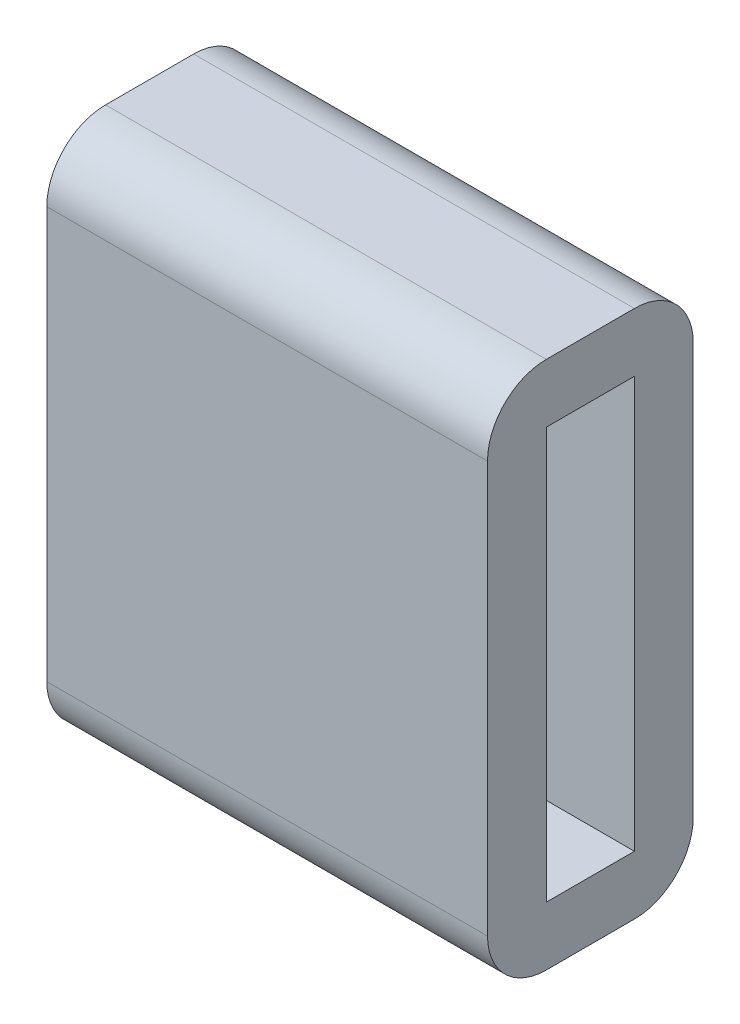
ISO-10303-21;
HEADER;
FILE_DESCRIPTION(('STEP AP214'),'2;1');
FILE_NAME('part.step','',(''),(''),'','','');
FILE_SCHEMA(('AUTOMOTIVE_DESIGN { 1 0 10303 214 1 1 1 1 }'));
ENDSEC;
DATA;
#1=APPLICATION_CONTEXT('core data for automotive mechanical design processes');
#2=APPLICATION_PROTOCOL_DEFINITION('international standard','automotive_design',2000,#1);
#3=PRODUCT_CONTEXT('',#1,'mechanical');
#4=PRODUCT('Part','Part','',(#3));
#5=PRODUCT_RELATED_PRODUCT_CATEGORY('part','',(#4));
#6=PRODUCT_DEFINITION_FORMATION('','',#4);
#7=PRODUCT_DEFINITION_CONTEXT('part definition',#1,'design');
#8=PRODUCT_DEFINITION('design','',#6,#7);
#9=PRODUCT_DEFINITION_SHAPE('','',#8);
#10=(LENGTH_UNIT() NAMED_UNIT(*) SI_UNIT(.MILLI.,.METRE.));
#11=(NAMED_UNIT(*) PLANE_ANGLE_UNIT() SI_UNIT($,.RADIAN.));
#12=(NAMED_UNIT(*) SI_UNIT($,.STERADIAN.) SOLID_ANGLE_UNIT());
#13=UNCERTAINTY_MEASURE_WITH_UNIT(LENGTH_MEASURE(1.E-05),#10,'distance_accuracy_value','');
#14=(GEOMETRIC_REPRESENTATION_CONTEXT(3) GLOBAL_UNCERTAINTY_ASSIGNED_CONTEXT((#13)) GLOBAL_UNIT_ASSIGNED_CONTEXT((#10,
#11,#12)) REPRESENTATION_CONTEXT('',''));
#15=CARTESIAN_POINT('',(0.,0.,0.));
#16=DIRECTION('',(0.,0.,1.));
#17=DIRECTION('',(1.,0.,0.));
#18=AXIS2_PLACEMENT_3D('',#15,#16,#17);
#19=CARTESIAN_POINT('',(3.75,4.5,3.5));
#20=DIRECTION('',(-1.,0.,0.));
#21=DIRECTION('',(0.,-1.,0.));
#22=AXIS2_PLACEMENT_3D('',#19,#20,#21);
#23=PLANE('',#22);
#24=DIRECTION('',(0.,0.,-1.));
#25=VECTOR('',#24,1.);
#26=CARTESIAN_POINT('',(3.75,-4.5,3.5));
#27=LINE('',#26,#25);
#28=CARTESIAN_POINT('',(3.75,-4.5,2.5));
#29=VERTEX_POINT('',#28);
#30=CARTESIAN_POINT('',(3.75,-4.5,1.));
#31=VERTEX_POINT('',#30);
#32=EDGE_CURVE('E159',#29,#31,#27,.T.);
#33=ORIENTED_EDGE('',*,*,#32,.T.);
#34=CARTESIAN_POINT('',(3.75,-3.5,1.));
#35=DIRECTION('',(-1.,0.,0.));
#36=DIRECTION('',(0.,-1.,0.));
#37=AXIS2_PLACEMENT_3D('',#34,#35,#36);
#38=CIRCLE('',#37,1.);
#39=CARTESIAN_POINT('',(3.75,-3.5,0.));
#40=VERTEX_POINT('',#39);
#41=EDGE_CURVE('E185',#31,#40,#38,.F.);
#42=ORIENTED_EDGE('',*,*,#41,.T.);
#43=DIRECTION('',(0.,1.,0.));
#44=VECTOR('',#43,1.);
#45=CARTESIAN_POINT('',(3.75,4.5,0.));
#46=LINE('',#45,#44);
#47=CARTESIAN_POINT('',(3.75,3.5,0.));
#48=VERTEX_POINT('',#47);
#49=EDGE_CURVE('E144',#40,#48,#46,.T.);
#50=ORIENTED_EDGE('',*,*,#49,.T.);
#51=CARTESIAN_POINT('',(3.75,3.5,1.));
#52=DIRECTION('',(-1.,0.,0.));
#53=DIRECTION('',(0.,-1.,0.));
#54=AXIS2_PLACEMENT_3D('',#51,#52,#53);
#55=CIRCLE('',#54,1.);
#56=CARTESIAN_POINT('',(3.75,4.5,1.));
#57=VERTEX_POINT('',#56);
#58=EDGE_CURVE('E183',#48,#57,#55,.F.);
#59=ORIENTED_EDGE('',*,*,#58,.T.);
#60=DIRECTION('',(0.,0.,-1.));
#61=VECTOR('',#60,1.);
#62=CARTESIAN_POINT('',(3.75,4.5,3.5));
#63=LINE('',#62,#61);
#64=CARTESIAN_POINT('',(3.75,4.5,2.5));
#65=VERTEX_POINT('',#64);
#66=EDGE_CURVE('E171',#65,#57,#63,.T.);
#67=ORIENTED_EDGE('',*,*,#66,.F.);
#68=CARTESIAN_POINT('',(3.75,3.5,2.5));
#69=DIRECTION('',(-1.,0.,0.));
#70=DIRECTION('',(0.,-1.,0.));
#71=AXIS2_PLACEMENT_3D('',#68,#69,#70);
#72=CIRCLE('',#71,1.);
#73=CARTESIAN_POINT('',(3.75,3.5,3.5));
#74=VERTEX_POINT('',#73);
#75=EDGE_CURVE('E179',#65,#74,#72,.F.);
#76=ORIENTED_EDGE('',*,*,#75,.T.);
#77=DIRECTION('',(0.,1.,0.));
#78=VECTOR('',#77,1.);
#79=CARTESIAN_POINT('',(3.75,4.5,3.5));
#80=LINE('',#79,#78);
#81=CARTESIAN_POINT('',(3.75,-3.5,3.5));
#82=VERTEX_POINT('',#81);
#83=EDGE_CURVE('E154',#82,#74,#80,.T.);
#84=ORIENTED_EDGE('',*,*,#83,.F.);
#85=CARTESIAN_POINT('',(3.75,-3.5,2.5));
#86=DIRECTION('',(-1.,0.,0.));
#87=DIRECTION('',(0.,-1.,0.));
#88=AXIS2_PLACEMENT_3D('',#85,#86,#87);
#89=CIRCLE('',#88,1.);
#90=EDGE_CURVE('E181',#82,#29,#89,.F.);
#91=ORIENTED_EDGE('',*,*,#90,.T.);
#92=EDGE_LOOP('',(#33,#42,#50,#59,#67,#76,#84,#91));
#93=FACE_BOUND('',#92,.T.);
#94=DIRECTION('',(0.,0.,-1.));
#95=VECTOR('',#94,1.);
#96=CARTESIAN_POINT('',(3.75,3.5,2.5));
#97=LINE('',#96,#95);
#98=CARTESIAN_POINT('',(3.75,3.5,2.5));
#99=VERTEX_POINT('',#98);
#100=CARTESIAN_POINT('',(3.75,3.5,1.));
#101=VERTEX_POINT('',#100);
#102=EDGE_CURVE('E48',#99,#101,#97,.T.);
#103=ORIENTED_EDGE('',*,*,#102,.T.);
#104=DIRECTION('',(0.,-1.,0.));
#105=VECTOR('',#104,1.);
#106=CARTESIAN_POINT('',(3.75,3.5,1.));
#107=LINE('',#106,#105);
#108=CARTESIAN_POINT('',(3.75,-3.5,0.999999999999999));
#109=VERTEX_POINT('',#108);
#110=EDGE_CURVE('E143',#101,#109,#107,.T.);
#111=ORIENTED_EDGE('',*,*,#110,.T.);
#112=DIRECTION('',(0.,0.,-1.));
#113=VECTOR('',#112,1.);
#114=CARTESIAN_POINT('',(3.75,-3.5,2.5));
#115=LINE('',#114,#113);
#116=CARTESIAN_POINT('',(3.75,-3.5,2.5));
#117=VERTEX_POINT('',#116);
#118=EDGE_CURVE('E339',#117,#109,#115,.T.);
#119=ORIENTED_EDGE('',*,*,#118,.F.);
#120=DIRECTION('',(0.,-1.,0.));
#121=VECTOR('',#120,1.);
#122=CARTESIAN_POINT('',(3.75,3.5,2.5));
#123=LINE('',#122,#121);
#124=EDGE_CURVE('E139',#99,#117,#123,.T.);
#125=ORIENTED_EDGE('',*,*,#124,.F.);
#126=EDGE_LOOP('',(#103,#111,#119,#125));
#127=FACE_BOUND('',#126,.T.);
#128=ADVANCED_FACE('F33',(#93,#127),#23,.F.);
#129=CARTESIAN_POINT('',(-3.75,4.5,3.5));
#130=DIRECTION('',(0.,-1.,0.));
#131=DIRECTION('',(0.,0.,-1.));
#132=AXIS2_PLACEMENT_3D('',#129,#130,#131);
#133=PLANE('',#132);
#134=ORIENTED_EDGE('',*,*,#66,.T.);
#135=DIRECTION('',(-1.,0.,0.));
#136=VECTOR('',#135,1.);
#137=CARTESIAN_POINT('',(-3.75,4.5,1.));
#138=LINE('',#137,#136);
#139=CARTESIAN_POINT('',(-3.75,4.5,1.));
#140=VERTEX_POINT('',#139);
#141=EDGE_CURVE('E200',#57,#140,#138,.T.);
#142=ORIENTED_EDGE('',*,*,#141,.T.);
#143=DIRECTION('',(0.,0.,-1.));
#144=VECTOR('',#143,1.);
#145=CARTESIAN_POINT('',(-3.75,4.5,3.5));
#146=LINE('',#145,#144);
#147=CARTESIAN_POINT('',(-3.75,4.5,2.5));
#148=VERTEX_POINT('',#147);
#149=EDGE_CURVE('E168',#148,#140,#146,.T.);
#150=ORIENTED_EDGE('',*,*,#149,.F.);
#151=DIRECTION('',(-1.,0.,0.));
#152=VECTOR('',#151,1.);
#153=CARTESIAN_POINT('',(3.75,4.5,2.5));
#154=LINE('',#153,#152);
#155=EDGE_CURVE('E198',#148,#65,#154,.F.);
#156=ORIENTED_EDGE('',*,*,#155,.T.);
#157=EDGE_LOOP('',(#134,#142,#150,#156));
#158=FACE_BOUND('',#157,.T.);
#159=ADVANCED_FACE('F224',(#158),#133,.F.);
#160=CARTESIAN_POINT('',(-3.75,4.5,3.5));
#161=DIRECTION('',(1.,0.,0.));
#162=DIRECTION('',(0.,0.,-1.));
#163=AXIS2_PLACEMENT_3D('',#160,#161,#162);
#164=PLANE('',#163);
#165=DIRECTION('',(0.,-1.,0.));
#166=VECTOR('',#165,1.);
#167=CARTESIAN_POINT('',(-3.75,4.5,0.));
#168=LINE('',#167,#166);
#169=CARTESIAN_POINT('',(-3.75,3.5,0.));
#170=VERTEX_POINT('',#169);
#171=CARTESIAN_POINT('',(-3.75,-3.5,0.));
#172=VERTEX_POINT('',#171);
#173=EDGE_CURVE('E148',#170,#172,#168,.T.);
#174=ORIENTED_EDGE('',*,*,#173,.T.);
#175=CARTESIAN_POINT('',(-3.75,-3.5,1.));
#176=DIRECTION('',(1.,0.,0.));
#177=DIRECTION('',(0.,0.,-1.));
#178=AXIS2_PLACEMENT_3D('',#175,#176,#177);
#179=CIRCLE('',#178,1.);
#180=CARTESIAN_POINT('',(-3.75,-4.5,1.));
#181=VERTEX_POINT('',#180);
#182=EDGE_CURVE('E196',#172,#181,#179,.F.);
#183=ORIENTED_EDGE('',*,*,#182,.T.);
#184=DIRECTION('',(0.,0.,-1.));
#185=VECTOR('',#184,1.);
#186=CARTESIAN_POINT('',(-3.75,-4.5,3.5));
#187=LINE('',#186,#185);
#188=CARTESIAN_POINT('',(-3.75,-4.5,2.5));
#189=VERTEX_POINT('',#188);
#190=EDGE_CURVE('E165',#189,#181,#187,.T.);
#191=ORIENTED_EDGE('',*,*,#190,.F.);
#192=CARTESIAN_POINT('',(-3.75,-3.5,2.5));
#193=DIRECTION('',(1.,0.,0.));
#194=DIRECTION('',(0.,0.,-1.));
#195=AXIS2_PLACEMENT_3D('',#192,#193,#194);
#196=CIRCLE('',#195,1.);
#197=CARTESIAN_POINT('',(-3.75,-3.5,3.5));
#198=VERTEX_POINT('',#197);
#199=EDGE_CURVE('E193',#189,#198,#196,.F.);
#200=ORIENTED_EDGE('',*,*,#199,.T.);
#201=DIRECTION('',(0.,-1.,0.));
#202=VECTOR('',#201,1.);
#203=CARTESIAN_POINT('',(-3.75,4.5,3.5));
#204=LINE('',#203,#202);
#205=CARTESIAN_POINT('',(-3.75,3.5,3.5));
#206=VERTEX_POINT('',#205);
#207=EDGE_CURVE('E157',#206,#198,#204,.T.);
#208=ORIENTED_EDGE('',*,*,#207,.F.);
#209=CARTESIAN_POINT('',(-3.75,3.5,2.5));
#210=DIRECTION('',(1.,0.,0.));
#211=DIRECTION('',(0.,0.,-1.));
#212=AXIS2_PLACEMENT_3D('',#209,#210,#211);
#213=CIRCLE('',#212,1.);
#214=EDGE_CURVE('E191',#206,#148,#213,.F.);
#215=ORIENTED_EDGE('',*,*,#214,.T.);
#216=ORIENTED_EDGE('',*,*,#149,.T.);
#217=CARTESIAN_POINT('',(-3.75,3.5,1.));
#218=DIRECTION('',(1.,0.,0.));
#219=DIRECTION('',(0.,0.,-1.));
#220=AXIS2_PLACEMENT_3D('',#217,#218,#219);
#221=CIRCLE('',#220,1.);
#222=EDGE_CURVE('E56',#140,#170,#221,.F.);
#223=ORIENTED_EDGE('',*,*,#222,.T.);
#224=EDGE_LOOP('',(#174,#183,#191,#200,#208,#215,#216,#223));
#225=FACE_BOUND('',#224,.T.);
#226=ADVANCED_FACE('F211',(#225),#164,.F.);
#227=CARTESIAN_POINT('',(-3.75,-4.5,3.5));
#228=DIRECTION('',(0.,1.,0.));
#229=DIRECTION('',(0.,0.,1.));
#230=AXIS2_PLACEMENT_3D('',#227,#228,#229);
#231=PLANE('',#230);
#232=ORIENTED_EDGE('',*,*,#190,.T.);
#233=DIRECTION('',(1.,0.,0.));
#234=VECTOR('',#233,1.);
#235=CARTESIAN_POINT('',(-3.75,-4.5,1.));
#236=LINE('',#235,#234);
#237=EDGE_CURVE('E176',#181,#31,#236,.T.);
#238=ORIENTED_EDGE('',*,*,#237,.T.);
#239=ORIENTED_EDGE('',*,*,#32,.F.);
#240=DIRECTION('',(1.,0.,0.));
#241=VECTOR('',#240,1.);
#242=CARTESIAN_POINT('',(-3.75,-4.5,2.5));
#243=LINE('',#242,#241);
#244=EDGE_CURVE('E174',#29,#189,#243,.F.);
#245=ORIENTED_EDGE('',*,*,#244,.T.);
#246=EDGE_LOOP('',(#232,#238,#239,#245));
#247=FACE_BOUND('',#246,.T.);
#248=ADVANCED_FACE('F237',(#247),#231,.F.);
#249=CARTESIAN_POINT('',(0.,0.,3.5));
#250=DIRECTION('',(0.,0.,1.));
#251=DIRECTION('',(1.,0.,0.));
#252=AXIS2_PLACEMENT_3D('',#249,#250,#251);
#253=PLANE('',#252);
#254=ORIENTED_EDGE('',*,*,#207,.T.);
#255=DIRECTION('',(1.,0.,0.));
#256=VECTOR('',#255,1.);
#257=CARTESIAN_POINT('',(3.75,-3.5,3.5));
#258=LINE('',#257,#256);
#259=EDGE_CURVE('E11',#198,#82,#258,.T.);
#260=ORIENTED_EDGE('',*,*,#259,.T.);
#261=ORIENTED_EDGE('',*,*,#83,.T.);
#262=DIRECTION('',(-1.,0.,0.));
#263=VECTOR('',#262,1.);
#264=CARTESIAN_POINT('',(-3.75,3.5,3.5));
#265=LINE('',#264,#263);
#266=EDGE_CURVE('E41',#74,#206,#265,.T.);
#267=ORIENTED_EDGE('',*,*,#266,.T.);
#268=EDGE_LOOP('',(#254,#260,#261,#267));
#269=FACE_BOUND('',#268,.T.);
#270=ADVANCED_FACE('F205',(#269),#253,.T.);
#271=CARTESIAN_POINT('',(0.,0.,0.));
#272=DIRECTION('',(0.,0.,1.));
#273=DIRECTION('',(1.,0.,0.));
#274=AXIS2_PLACEMENT_3D('',#271,#272,#273);
#275=PLANE('',#274);
#276=ORIENTED_EDGE('',*,*,#49,.F.);
#277=DIRECTION('',(1.,0.,0.));
#278=VECTOR('',#277,1.);
#279=CARTESIAN_POINT('',(0.,-3.5,0.));
#280=LINE('',#279,#278);
#281=EDGE_CURVE('E189',#40,#172,#280,.F.);
#282=ORIENTED_EDGE('',*,*,#281,.T.);
#283=ORIENTED_EDGE('',*,*,#173,.F.);
#284=DIRECTION('',(-1.,0.,0.));
#285=VECTOR('',#284,1.);
#286=CARTESIAN_POINT('',(0.,3.5,0.));
#287=LINE('',#286,#285);
#288=EDGE_CURVE('E187',#170,#48,#287,.F.);
#289=ORIENTED_EDGE('',*,*,#288,.T.);
#290=EDGE_LOOP('',(#276,#282,#283,#289));
#291=FACE_BOUND('',#290,.T.);
#292=ADVANCED_FACE('F229',(#291),#275,.F.);
#293=CARTESIAN_POINT('',(-3.75,-3.5,1.));
#294=DIRECTION('',(1.,0.,0.));
#295=DIRECTION('',(0.,0.,-1.));
#296=AXIS2_PLACEMENT_3D('',#293,#294,#295);
#297=CYLINDRICAL_SURFACE('',#296,1.);
#298=ORIENTED_EDGE('',*,*,#182,.F.);
#299=ORIENTED_EDGE('',*,*,#281,.F.);
#300=ORIENTED_EDGE('',*,*,#41,.F.);
#301=ORIENTED_EDGE('',*,*,#237,.F.);
#302=EDGE_LOOP('',(#298,#299,#300,#301));
#303=FACE_BOUND('',#302,.T.);
#304=ADVANCED_FACE('F234',(#303),#297,.T.);
#305=CARTESIAN_POINT('',(-3.75,3.5,1.));
#306=DIRECTION('',(-1.,0.,0.));
#307=DIRECTION('',(0.,0.,1.));
#308=AXIS2_PLACEMENT_3D('',#305,#306,#307);
#309=CYLINDRICAL_SURFACE('',#308,1.);
#310=ORIENTED_EDGE('',*,*,#58,.F.);
#311=ORIENTED_EDGE('',*,*,#288,.F.);
#312=ORIENTED_EDGE('',*,*,#222,.F.);
#313=ORIENTED_EDGE('',*,*,#141,.F.);
#314=EDGE_LOOP('',(#310,#311,#312,#313));
#315=FACE_BOUND('',#314,.T.);
#316=ADVANCED_FACE('F232',(#315),#309,.T.);
#317=CARTESIAN_POINT('',(0.,-3.5,2.5));
#318=DIRECTION('',(-1.,0.,0.));
#319=DIRECTION('',(0.,0.,1.));
#320=AXIS2_PLACEMENT_3D('',#317,#318,#319);
#321=CYLINDRICAL_SURFACE('',#320,1.);
#322=ORIENTED_EDGE('',*,*,#199,.F.);
#323=ORIENTED_EDGE('',*,*,#244,.F.);
#324=ORIENTED_EDGE('',*,*,#90,.F.);
#325=ORIENTED_EDGE('',*,*,#259,.F.);
#326=EDGE_LOOP('',(#322,#323,#324,#325));
#327=FACE_BOUND('',#326,.T.);
#328=ADVANCED_FACE('F217',(#327),#321,.T.);
#329=CARTESIAN_POINT('',(0.,3.5,2.5));
#330=DIRECTION('',(1.,0.,0.));
#331=DIRECTION('',(0.,0.,-1.));
#332=AXIS2_PLACEMENT_3D('',#329,#330,#331);
#333=CYLINDRICAL_SURFACE('',#332,1.);
#334=ORIENTED_EDGE('',*,*,#75,.F.);
#335=ORIENTED_EDGE('',*,*,#155,.F.);
#336=ORIENTED_EDGE('',*,*,#214,.F.);
#337=ORIENTED_EDGE('',*,*,#266,.F.);
#338=EDGE_LOOP('',(#334,#335,#336,#337));
#339=FACE_BOUND('',#338,.T.);
#340=ADVANCED_FACE('F35',(#339),#333,.T.);
#341=CARTESIAN_POINT('',(-1.25,3.5,2.5));
#342=DIRECTION('',(0.,-1.,0.));
#343=DIRECTION('',(1.,0.,0.));
#344=AXIS2_PLACEMENT_3D('',#341,#342,#343);
#345=PLANE('',#344);
#346=ORIENTED_EDGE('',*,*,#102,.F.);
#347=DIRECTION('',(1.,0.,0.));
#348=VECTOR('',#347,1.);
#349=CARTESIAN_POINT('',(-1.25,3.5,2.5));
#350=LINE('',#349,#348);
#351=CARTESIAN_POINT('',(-1.25,3.5,2.5));
#352=VERTEX_POINT('',#351);
#353=EDGE_CURVE('E138',#352,#99,#350,.T.);
#354=ORIENTED_EDGE('',*,*,#353,.F.);
#355=DIRECTION('',(0.,0.,-1.));
#356=VECTOR('',#355,1.);
#357=CARTESIAN_POINT('',(-1.25,3.5,2.5));
#358=LINE('',#357,#356);
#359=CARTESIAN_POINT('',(-1.25,3.5,1.));
#360=VERTEX_POINT('',#359);
#361=EDGE_CURVE('E128',#352,#360,#358,.T.);
#362=ORIENTED_EDGE('',*,*,#361,.T.);
#363=DIRECTION('',(1.,0.,0.));
#364=VECTOR('',#363,1.);
#365=CARTESIAN_POINT('',(-1.25,3.5,1.));
#366=LINE('',#365,#364);
#367=EDGE_CURVE('E137',#360,#101,#366,.T.);
#368=ORIENTED_EDGE('',*,*,#367,.T.);
#369=EDGE_LOOP('',(#346,#354,#362,#368));
#370=FACE_BOUND('',#369,.T.);
#371=ADVANCED_FACE('F136',(#370),#345,.T.);
#372=CARTESIAN_POINT('',(-1.25,3.5,1.));
#373=DIRECTION('',(0.,0.,1.));
#374=DIRECTION('',(0.,-1.,0.));
#375=AXIS2_PLACEMENT_3D('',#372,#373,#374);
#376=PLANE('',#375);
#377=ORIENTED_EDGE('',*,*,#110,.F.);
#378=ORIENTED_EDGE('',*,*,#367,.F.);
#379=DIRECTION('',(0.,-1.,0.));
#380=VECTOR('',#379,1.);
#381=CARTESIAN_POINT('',(-1.25,3.5,1.));
#382=LINE('',#381,#380);
#383=CARTESIAN_POINT('',(-1.25,-3.5,0.999999999999999));
#384=VERTEX_POINT('',#383);
#385=EDGE_CURVE('E124',#360,#384,#382,.T.);
#386=ORIENTED_EDGE('',*,*,#385,.T.);
#387=DIRECTION('',(1.,0.,0.));
#388=VECTOR('',#387,1.);
#389=CARTESIAN_POINT('',(-1.25,-3.5,0.999999999999999));
#390=LINE('',#389,#388);
#391=EDGE_CURVE('E145',#384,#109,#390,.T.);
#392=ORIENTED_EDGE('',*,*,#391,.T.);
#393=EDGE_LOOP('',(#377,#378,#386,#392));
#394=FACE_BOUND('',#393,.T.);
#395=ADVANCED_FACE('F141',(#394),#376,.T.);
#396=CARTESIAN_POINT('',(-1.25,-3.5,2.5));
#397=DIRECTION('',(0.,-1.,0.));
#398=DIRECTION('',(1.,0.,0.));
#399=AXIS2_PLACEMENT_3D('',#396,#397,#398);
#400=PLANE('',#399);
#401=ORIENTED_EDGE('',*,*,#118,.T.);
#402=ORIENTED_EDGE('',*,*,#391,.F.);
#403=DIRECTION('',(0.,0.,-1.));
#404=VECTOR('',#403,1.);
#405=CARTESIAN_POINT('',(-1.25,-3.5,2.5));
#406=LINE('',#405,#404);
#407=CARTESIAN_POINT('',(-1.25,-3.5,2.5));
#408=VERTEX_POINT('',#407);
#409=EDGE_CURVE('E131',#408,#384,#406,.T.);
#410=ORIENTED_EDGE('',*,*,#409,.F.);
#411=DIRECTION('',(1.,0.,0.));
#412=VECTOR('',#411,1.);
#413=CARTESIAN_POINT('',(-1.25,-3.5,2.5));
#414=LINE('',#413,#412);
#415=EDGE_CURVE('E150',#408,#117,#414,.T.);
#416=ORIENTED_EDGE('',*,*,#415,.T.);
#417=EDGE_LOOP('',(#401,#402,#410,#416));
#418=FACE_BOUND('',#417,.T.);
#419=ADVANCED_FACE('F268',(#418),#400,.F.);
#420=CARTESIAN_POINT('',(-1.25,3.5,2.5));
#421=DIRECTION('',(0.,0.,1.));
#422=DIRECTION('',(0.,-1.,0.));
#423=AXIS2_PLACEMENT_3D('',#420,#421,#422);
#424=PLANE('',#423);
#425=ORIENTED_EDGE('',*,*,#124,.T.);
#426=ORIENTED_EDGE('',*,*,#415,.F.);
#427=DIRECTION('',(0.,-1.,0.));
#428=VECTOR('',#427,1.);
#429=CARTESIAN_POINT('',(-1.25,3.5,2.5));
#430=LINE('',#429,#428);
#431=EDGE_CURVE('E346',#352,#408,#430,.T.);
#432=ORIENTED_EDGE('',*,*,#431,.F.);
#433=ORIENTED_EDGE('',*,*,#353,.T.);
#434=EDGE_LOOP('',(#425,#426,#432,#433));
#435=FACE_BOUND('',#434,.T.);
#436=ADVANCED_FACE('F315',(#435),#424,.F.);
#437=CARTESIAN_POINT('',(-1.25,0.,0.));
#438=DIRECTION('',(-1.,0.,0.));
#439=DIRECTION('',(0.,-1.,0.));
#440=AXIS2_PLACEMENT_3D('',#437,#438,#439);
#441=PLANE('',#440);
#442=ORIENTED_EDGE('',*,*,#361,.F.);
#443=ORIENTED_EDGE('',*,*,#431,.T.);
#444=ORIENTED_EDGE('',*,*,#409,.T.);
#445=ORIENTED_EDGE('',*,*,#385,.F.);
#446=EDGE_LOOP('',(#442,#443,#444,#445));
#447=FACE_BOUND('',#446,.T.);
#448=ADVANCED_FACE('F126',(#447),#441,.F.);
#449=CLOSED_SHELL('',(#128,#159,#226,#248,#270,#292,#304,#316,#328,#340,#371,#395,#419,#436,#448));
#450=MANIFOLD_SOLID_BREP('B2',#449);
#451=ADVANCED_BREP_SHAPE_REPRESENTATION('',(#18,#450),#14);
#452=SHAPE_DEFINITION_REPRESENTATION(#9,#451);
ENDSEC;
END-ISO-10303-21;
